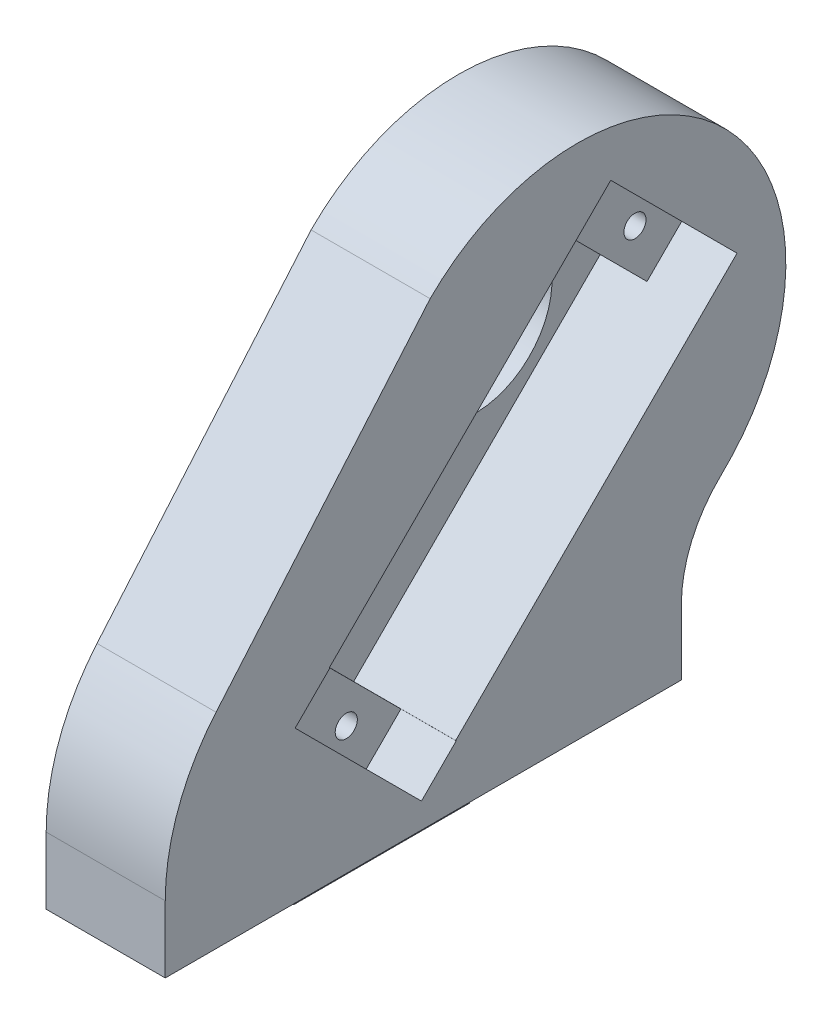
ISO-10303-21;
HEADER;
FILE_DESCRIPTION(('STEP AP214'),'2;1');
FILE_NAME('part.step','',(''),(''),'','','');
FILE_SCHEMA(('AUTOMOTIVE_DESIGN { 1 0 10303 214 1 1 1 1 }'));
ENDSEC;
DATA;
#1=APPLICATION_CONTEXT('core data for automotive mechanical design processes');
#2=APPLICATION_PROTOCOL_DEFINITION('international standard','automotive_design',2000,#1);
#3=PRODUCT_CONTEXT('',#1,'mechanical');
#4=PRODUCT('Part','Part','',(#3));
#5=PRODUCT_RELATED_PRODUCT_CATEGORY('part','',(#4));
#6=PRODUCT_DEFINITION_FORMATION('','',#4);
#7=PRODUCT_DEFINITION_CONTEXT('part definition',#1,'design');
#8=PRODUCT_DEFINITION('design','',#6,#7);
#9=PRODUCT_DEFINITION_SHAPE('','',#8);
#10=(LENGTH_UNIT() NAMED_UNIT(*) SI_UNIT(.MILLI.,.METRE.));
#11=(NAMED_UNIT(*) PLANE_ANGLE_UNIT() SI_UNIT($,.RADIAN.));
#12=(NAMED_UNIT(*) SI_UNIT($,.STERADIAN.) SOLID_ANGLE_UNIT());
#13=UNCERTAINTY_MEASURE_WITH_UNIT(LENGTH_MEASURE(1.E-05),#10,'distance_accuracy_value','');
#14=(GEOMETRIC_REPRESENTATION_CONTEXT(3) GLOBAL_UNCERTAINTY_ASSIGNED_CONTEXT((#13)) GLOBAL_UNIT_ASSIGNED_CONTEXT((#10,
#11,#12)) REPRESENTATION_CONTEXT('',''));
#15=CARTESIAN_POINT('',(0.,0.,0.));
#16=DIRECTION('',(0.,0.,1.));
#17=DIRECTION('',(1.,0.,0.));
#18=AXIS2_PLACEMENT_3D('',#15,#16,#17);
#19=CARTESIAN_POINT('',(-1.99999999999999,54.948945885554,-13.741729606692));
#20=DIRECTION('',(0.,0.707106781186547,-0.707106781186548));
#21=DIRECTION('',(0.,0.707106781186548,0.707106781186547));
#22=AXIS2_PLACEMENT_3D('',#19,#20,#21);
#23=PLANE('',#22);
#24=DIRECTION('',(0.,-0.707106781186548,-0.707106781186547));
#25=VECTOR('',#24,1.);
#26=CARTESIAN_POINT('',(3.5,54.948945885554,-13.741729606692));
#27=LINE('',#26,#25);
#28=CARTESIAN_POINT('',(3.5,54.948945885554,-13.741729606692));
#29=VERTEX_POINT('',#28);
#30=CARTESIAN_POINT('',(3.5,40.0997034806365,-28.5909720116095));
#31=VERTEX_POINT('',#30);
#32=EDGE_CURVE('E833',#29,#31,#27,.T.);
#33=ORIENTED_EDGE('',*,*,#32,.F.);
#34=DIRECTION('',(1.,0.,0.));
#35=VECTOR('',#34,1.);
#36=CARTESIAN_POINT('',(-1.99999999999999,54.948945885554,-13.741729606692));
#37=LINE('',#36,#35);
#38=CARTESIAN_POINT('',(-1.99999999999999,54.948945885554,-13.741729606692));
#39=VERTEX_POINT('',#38);
#40=EDGE_CURVE('E906',#39,#29,#37,.T.);
#41=ORIENTED_EDGE('',*,*,#40,.F.);
#42=DIRECTION('',(0.,-0.707106781186548,-0.707106781186547));
#43=VECTOR('',#42,1.);
#44=CARTESIAN_POINT('',(-1.99999999999999,54.948945885554,-13.741729606692));
#45=LINE('',#44,#43);
#46=CARTESIAN_POINT('',(-1.99999999999999,40.0997034806365,-28.5909720116095));
#47=VERTEX_POINT('',#46);
#48=EDGE_CURVE('E890',#39,#47,#45,.T.);
#49=ORIENTED_EDGE('',*,*,#48,.T.);
#50=DIRECTION('',(1.,0.,0.));
#51=VECTOR('',#50,1.);
#52=CARTESIAN_POINT('',(-1.99999999999999,40.0997034806365,-28.5909720116095));
#53=LINE('',#52,#51);
#54=EDGE_CURVE('E904',#47,#31,#53,.T.);
#55=ORIENTED_EDGE('',*,*,#54,.T.);
#56=EDGE_LOOP('',(#33,#41,#49,#55));
#57=FACE_BOUND('',#56,.T.);
#58=ADVANCED_FACE('F65',(#57),#23,.F.);
#59=CARTESIAN_POINT('',(-7.99999999999999,4.,0.));
#60=DIRECTION('',(0.,1.,0.));
#61=DIRECTION('',(-1.,0.,0.));
#62=AXIS2_PLACEMENT_3D('',#59,#60,#61);
#63=PLANE('',#62);
#64=DIRECTION('',(1.,0.,0.));
#65=VECTOR('',#64,1.);
#66=CARTESIAN_POINT('',(-98.9638448287514,4.,-26.1299478736219));
#67=LINE('',#66,#65);
#68=CARTESIAN_POINT('',(-4.,4.,-26.1299478736219));
#69=VERTEX_POINT('',#68);
#70=CARTESIAN_POINT('',(10.,4.,-26.1299478736219));
#71=VERTEX_POINT('',#70);
#72=EDGE_CURVE('E278',#69,#71,#67,.T.);
#73=ORIENTED_EDGE('',*,*,#72,.T.);
#74=DIRECTION('',(0.,0.,1.));
#75=VECTOR('',#74,1.);
#76=CARTESIAN_POINT('',(10.,4.,-15.1299478736219));
#77=LINE('',#76,#75);
#78=CARTESIAN_POINT('',(10.,4.,34.549646217337));
#79=VERTEX_POINT('',#78);
#80=EDGE_CURVE('E903',#71,#79,#77,.T.);
#81=ORIENTED_EDGE('',*,*,#80,.T.);
#82=DIRECTION('',(-1.,0.,0.));
#83=VECTOR('',#82,1.);
#84=CARTESIAN_POINT('',(10.,4.,34.5496462173369));
#85=LINE('',#84,#83);
#86=CARTESIAN_POINT('',(-4.,4.,34.549646217337));
#87=VERTEX_POINT('',#86);
#88=EDGE_CURVE('E222',#79,#87,#85,.T.);
#89=ORIENTED_EDGE('',*,*,#88,.T.);
#90=DIRECTION('',(0.,0.,-1.));
#91=VECTOR('',#90,1.);
#92=CARTESIAN_POINT('',(-4.,4.,-26.1299478736219));
#93=LINE('',#92,#91);
#94=EDGE_CURVE('E271',#87,#69,#93,.T.);
#95=ORIENTED_EDGE('',*,*,#94,.T.);
#96=EDGE_LOOP('',(#73,#81,#89,#95));
#97=FACE_BOUND('',#96,.T.);
#98=DIRECTION('',(0.,0.,-1.));
#99=VECTOR('',#98,1.);
#100=CARTESIAN_POINT('',(6.0919121161501,4.,15.549646217337));
#101=LINE('',#100,#99);
#102=CARTESIAN_POINT('',(6.0919121161501,4.,15.549646217337));
#103=VERTEX_POINT('',#102);
#104=CARTESIAN_POINT('',(6.0919121161501,4.,-5.15035378266305));
#105=VERTEX_POINT('',#104);
#106=EDGE_CURVE('E841',#103,#105,#101,.T.);
#107=ORIENTED_EDGE('',*,*,#106,.T.);
#108=DIRECTION('',(-1.,0.,0.));
#109=VECTOR('',#108,1.);
#110=CARTESIAN_POINT('',(6.0919121161501,4.,-5.15035378266305));
#111=LINE('',#110,#109);
#112=CARTESIAN_POINT('',(-0.908087883849897,4.,-5.15035378266305));
#113=VERTEX_POINT('',#112);
#114=EDGE_CURVE('E844',#105,#113,#111,.T.);
#115=ORIENTED_EDGE('',*,*,#114,.T.);
#116=DIRECTION('',(0.,0.,1.));
#117=VECTOR('',#116,1.);
#118=CARTESIAN_POINT('',(-0.908087883849897,4.,15.549646217337));
#119=LINE('',#118,#117);
#120=CARTESIAN_POINT('',(-0.908087883849897,4.,15.549646217337));
#121=VERTEX_POINT('',#120);
#122=EDGE_CURVE('E865',#113,#121,#119,.T.);
#123=ORIENTED_EDGE('',*,*,#122,.T.);
#124=DIRECTION('',(1.,0.,0.));
#125=VECTOR('',#124,1.);
#126=CARTESIAN_POINT('',(6.0919121161501,4.,15.549646217337));
#127=LINE('',#126,#125);
#128=EDGE_CURVE('E854',#121,#103,#127,.T.);
#129=ORIENTED_EDGE('',*,*,#128,.T.);
#130=EDGE_LOOP('',(#107,#115,#123,#129));
#131=FACE_BOUND('',#130,.T.);
#132=ADVANCED_FACE('F722',(#97,#131),#63,.F.);
#133=CARTESIAN_POINT('',(-98.9638448287514,0.,-26.1299478736219));
#134=DIRECTION('',(0.,0.,-1.));
#135=DIRECTION('',(1.,0.,0.));
#136=AXIS2_PLACEMENT_3D('',#133,#134,#135);
#137=PLANE('',#136);
#138=DIRECTION('',(0.,1.,0.));
#139=VECTOR('',#138,1.);
#140=CARTESIAN_POINT('',(10.,0.,-26.1299478736219));
#141=LINE('',#140,#139);
#142=CARTESIAN_POINT('',(10.,11.644549615917,-26.1299478736219));
#143=VERTEX_POINT('',#142);
#144=EDGE_CURVE('E918',#71,#143,#141,.T.);
#145=ORIENTED_EDGE('',*,*,#144,.F.);
#146=ORIENTED_EDGE('',*,*,#72,.F.);
#147=DIRECTION('',(0.,1.,0.));
#148=VECTOR('',#147,1.);
#149=CARTESIAN_POINT('',(-4.,19.0366427296958,-26.1299478736219));
#150=LINE('',#149,#148);
#151=CARTESIAN_POINT('',(-4.,11.644549615917,-26.1299478736219));
#152=VERTEX_POINT('',#151);
#153=EDGE_CURVE('E268',#69,#152,#150,.T.);
#154=ORIENTED_EDGE('',*,*,#153,.T.);
#155=DIRECTION('',(-1.,0.,0.));
#156=VECTOR('',#155,1.);
#157=CARTESIAN_POINT('',(-4.,11.644549615917,-26.1299478736219));
#158=LINE('',#157,#156);
#159=EDGE_CURVE('E238',#143,#152,#158,.T.);
#160=ORIENTED_EDGE('',*,*,#159,.F.);
#161=EDGE_LOOP('',(#145,#146,#154,#160));
#162=FACE_BOUND('',#161,.T.);
#163=ADVANCED_FACE('F718',(#162),#137,.T.);
#164=CARTESIAN_POINT('',(-98.9638448287514,40.2764801759331,-13.9185063019886));
#165=DIRECTION('',(1.,0.,0.));
#166=DIRECTION('',(0.,0.,1.));
#167=AXIS2_PLACEMENT_3D('',#164,#165,#166);
#168=CYLINDRICAL_SURFACE('',#167,24.5);
#169=CARTESIAN_POINT('',(10.,40.2764801759331,-13.9185063019886));
#170=DIRECTION('',(-1.,0.,0.));
#171=DIRECTION('',(0.,0.,1.));
#172=AXIS2_PLACEMENT_3D('',#169,#170,#171);
#173=CIRCLE('',#172,24.5);
#174=CARTESIAN_POINT('',(10.,22.5174346387079,-30.796489048951));
#175=VERTEX_POINT('',#174);
#176=CARTESIAN_POINT('',(10.,57.6005963150038,3.40560983708185));
#177=VERTEX_POINT('',#176);
#178=EDGE_CURVE('E261',#175,#177,#173,.F.);
#179=ORIENTED_EDGE('',*,*,#178,.F.);
#180=DIRECTION('',(1.,0.,0.));
#181=VECTOR('',#180,1.);
#182=CARTESIAN_POINT('',(-98.9638448287514,22.5174346387079,-30.796489048951));
#183=LINE('',#182,#181);
#184=CARTESIAN_POINT('',(-4.,22.5174346387078,-30.7964890489511));
#185=VERTEX_POINT('',#184);
#186=EDGE_CURVE('E228',#185,#175,#183,.T.);
#187=ORIENTED_EDGE('',*,*,#186,.F.);
#188=CARTESIAN_POINT('',(-4.,40.2764801759331,-13.9185063019886));
#189=DIRECTION('',(1.,0.,0.));
#190=DIRECTION('',(0.,0.,1.));
#191=AXIS2_PLACEMENT_3D('',#188,#189,#190);
#192=CIRCLE('',#191,24.5000000000001);
#193=CARTESIAN_POINT('',(-4.,57.6005963150038,3.40560983708186));
#194=VERTEX_POINT('',#193);
#195=EDGE_CURVE('E260',#185,#194,#192,.T.);
#196=ORIENTED_EDGE('',*,*,#195,.T.);
#197=DIRECTION('',(1.,0.,0.));
#198=VECTOR('',#197,1.);
#199=CARTESIAN_POINT('',(-98.9638448287514,57.6005963150038,3.40560983708185));
#200=LINE('',#199,#198);
#201=EDGE_CURVE('E240',#194,#177,#200,.T.);
#202=ORIENTED_EDGE('',*,*,#201,.T.);
#203=EDGE_LOOP('',(#179,#187,#196,#202));
#204=FACE_BOUND('',#203,.T.);
#205=ADVANCED_FACE('F258',(#204),#168,.T.);
#206=CARTESIAN_POINT('',(-98.9638448287514,25.9248128608695,30.4097431541046));
#207=DIRECTION('',(0.,-0.648759583452649,-0.760993431560579));
#208=DIRECTION('',(0.,-0.760993431560579,0.648759583452649));
#209=AXIS2_PLACEMENT_3D('',#206,#207,#208);
#210=PLANE('',#209);
#211=DIRECTION('',(1.,0.,0.));
#212=VECTOR('',#211,1.);
#213=CARTESIAN_POINT('',(-98.9638448287514,28.0775697746182,28.5744820063514));
#214=LINE('',#213,#212);
#215=CARTESIAN_POINT('',(10.,28.0775697746182,28.5744820063514));
#216=VERTEX_POINT('',#215);
#217=CARTESIAN_POINT('',(-4.,28.0775697746182,28.5744820063514));
#218=VERTEX_POINT('',#217);
#219=EDGE_CURVE('E74',#216,#218,#214,.F.);
#220=ORIENTED_EDGE('',*,*,#219,.F.);
#221=DIRECTION('',(0.,0.760993431560579,-0.648759583452649));
#222=VECTOR('',#221,1.);
#223=CARTESIAN_POINT('',(10.,25.9248128608695,30.4097431541046));
#224=LINE('',#223,#222);
#225=EDGE_CURVE('E82',#216,#177,#224,.T.);
#226=ORIENTED_EDGE('',*,*,#225,.T.);
#227=ORIENTED_EDGE('',*,*,#201,.F.);
#228=DIRECTION('',(0.,-0.760993431560579,0.648759583452649));
#229=VECTOR('',#228,1.);
#230=CARTESIAN_POINT('',(-4.,21.0687165213735,34.549646217337));
#231=LINE('',#230,#229);
#232=EDGE_CURVE('E266',#194,#218,#231,.T.);
#233=ORIENTED_EDGE('',*,*,#232,.T.);
#234=EDGE_LOOP('',(#220,#226,#227,#233));
#235=FACE_BOUND('',#234,.T.);
#236=ADVANCED_FACE('F726',(#235),#210,.F.);
#237=CARTESIAN_POINT('',(10.,0.,34.5496462173369));
#238=DIRECTION('',(0.,0.,-1.));
#239=DIRECTION('',(1.,0.,0.));
#240=AXIS2_PLACEMENT_3D('',#237,#238,#239);
#241=PLANE('',#240);
#242=ORIENTED_EDGE('',*,*,#88,.F.);
#243=DIRECTION('',(0.,1.,0.));
#244=VECTOR('',#243,1.);
#245=CARTESIAN_POINT('',(10.,0.,34.5496462173369));
#246=LINE('',#245,#244);
#247=CARTESIAN_POINT('',(10.,11.858580188302,34.549646217337));
#248=VERTEX_POINT('',#247);
#249=EDGE_CURVE('E210',#79,#248,#246,.T.);
#250=ORIENTED_EDGE('',*,*,#249,.T.);
#251=DIRECTION('',(1.,0.,0.));
#252=VECTOR('',#251,1.);
#253=CARTESIAN_POINT('',(10.,11.858580188302,34.549646217337));
#254=LINE('',#253,#252);
#255=CARTESIAN_POINT('',(-4.,11.858580188302,34.549646217337));
#256=VERTEX_POINT('',#255);
#257=EDGE_CURVE('E220',#256,#248,#254,.T.);
#258=ORIENTED_EDGE('',*,*,#257,.F.);
#259=DIRECTION('',(0.,-1.,0.));
#260=VECTOR('',#259,1.);
#261=CARTESIAN_POINT('',(-4.,4.,34.549646217337));
#262=LINE('',#261,#260);
#263=EDGE_CURVE('E911',#256,#87,#262,.T.);
#264=ORIENTED_EDGE('',*,*,#263,.T.);
#265=EDGE_LOOP('',(#242,#250,#258,#264));
#266=FACE_BOUND('',#265,.T.);
#267=ADVANCED_FACE('F218',(#266),#241,.F.);
#268=CARTESIAN_POINT('',(-4.,40.2764801759331,-13.9185063019886));
#269=DIRECTION('',(1.,0.,0.));
#270=DIRECTION('',(0.,0.,1.));
#271=AXIS2_PLACEMENT_3D('',#268,#269,#270);
#272=PLANE('',#271);
#273=CARTESIAN_POINT('',(-4.,19.5936068262266,13.8354348595834));
#274=DIRECTION('',(1.,0.,0.));
#275=DIRECTION('',(0.,0.,-1.));
#276=AXIS2_PLACEMENT_3D('',#273,#274,#275);
#277=CIRCLE('',#276,1.29999999999999);
#278=CARTESIAN_POINT('',(-4.,19.5936068262266,12.5354348595834));
#279=VERTEX_POINT('',#278);
#280=EDGE_CURVE('E936',#279,#279,#277,.T.);
#281=ORIENTED_EDGE('',*,*,#280,.T.);
#282=EDGE_LOOP('',(#281));
#283=FACE_BOUND('',#282,.T.);
#284=CARTESIAN_POINT('',(-4.,12.5225390143611,6.76436704771787));
#285=DIRECTION('',(1.,0.,0.));
#286=DIRECTION('',(0.,0.,-1.));
#287=AXIS2_PLACEMENT_3D('',#284,#285,#286);
#288=CIRCLE('',#287,1.29999999999999);
#289=CARTESIAN_POINT('',(-4.,12.5225390143611,5.46436704771788));
#290=VERTEX_POINT('',#289);
#291=EDGE_CURVE('E942',#290,#290,#288,.T.);
#292=ORIENTED_EDGE('',*,*,#291,.T.);
#293=EDGE_LOOP('',(#292));
#294=FACE_BOUND('',#293,.T.);
#295=CARTESIAN_POINT('',(-4.,53.5347323231809,-20.1056906373709));
#296=DIRECTION('',(1.,0.,0.));
#297=DIRECTION('',(0.,0.,-1.));
#298=AXIS2_PLACEMENT_3D('',#295,#296,#297);
#299=CIRCLE('',#298,1.29999999999999);
#300=CARTESIAN_POINT('',(-4.,53.5347323231809,-21.4056906373709));
#301=VERTEX_POINT('',#300);
#302=EDGE_CURVE('E939',#301,#301,#299,.T.);
#303=ORIENTED_EDGE('',*,*,#302,.T.);
#304=EDGE_LOOP('',(#303));
#305=FACE_BOUND('',#304,.T.);
#306=CARTESIAN_POINT('',(-4.,46.4636645113155,-27.1767584492364));
#307=DIRECTION('',(1.,0.,0.));
#308=DIRECTION('',(0.,0.,-1.));
#309=AXIS2_PLACEMENT_3D('',#306,#307,#308);
#310=CIRCLE('',#309,1.29999999999999);
#311=CARTESIAN_POINT('',(-4.,46.4636645113155,-28.4767584492364));
#312=VERTEX_POINT('',#311);
#313=EDGE_CURVE('E933',#312,#312,#310,.T.);
#314=ORIENTED_EDGE('',*,*,#313,.T.);
#315=EDGE_LOOP('',(#314));
#316=FACE_BOUND('',#315,.T.);
#317=CARTESIAN_POINT('',(-4.,40.2764801759331,-13.9185063019886));
#318=DIRECTION('',(-1.,0.,0.));
#319=DIRECTION('',(0.,0.,1.));
#320=AXIS2_PLACEMENT_3D('',#317,#318,#319);
#321=CIRCLE('',#320,8.99999999999999);
#322=CARTESIAN_POINT('',(-4.,40.2764801759331,-4.91850630198863));
#323=VERTEX_POINT('',#322);
#324=EDGE_CURVE('E880',#323,#323,#321,.T.);
#325=ORIENTED_EDGE('',*,*,#324,.F.);
#326=EDGE_LOOP('',(#325));
#327=FACE_BOUND('',#326,.T.);
#328=ORIENTED_EDGE('',*,*,#232,.F.);
#329=ORIENTED_EDGE('',*,*,#195,.F.);
#330=CARTESIAN_POINT('',(-4.,11.644549615917,-41.1299478736219));
#331=DIRECTION('',(-1.,0.,0.));
#332=DIRECTION('',(0.,0.,1.));
#333=AXIS2_PLACEMENT_3D('',#330,#331,#332);
#334=CIRCLE('',#333,15.);
#335=EDGE_CURVE('E225',#152,#185,#334,.T.);
#336=ORIENTED_EDGE('',*,*,#335,.F.);
#337=ORIENTED_EDGE('',*,*,#153,.F.);
#338=ORIENTED_EDGE('',*,*,#94,.F.);
#339=ORIENTED_EDGE('',*,*,#263,.F.);
#340=CARTESIAN_POINT('',(-4.,11.858580188302,9.54964621733696));
#341=DIRECTION('',(-1.,0.,0.));
#342=DIRECTION('',(0.,0.,1.));
#343=AXIS2_PLACEMENT_3D('',#340,#341,#342);
#344=CIRCLE('',#343,25.);
#345=EDGE_CURVE('E13',#218,#256,#344,.F.);
#346=ORIENTED_EDGE('',*,*,#345,.F.);
#347=EDGE_LOOP('',(#328,#329,#336,#337,#338,#339,#346));
#348=FACE_BOUND('',#347,.T.);
#349=ADVANCED_FACE('F263',(#283,#294,#305,#316,#327,#348),#272,.F.);
#350=CARTESIAN_POINT('',(10.,24.7119793601216,22.6009444067097));
#351=DIRECTION('',(1.,0.,0.));
#352=DIRECTION('',(0.,0.,1.));
#353=AXIS2_PLACEMENT_3D('',#350,#351,#352);
#354=PLANE('',#353);
#355=DIRECTION('',(0.,0.707106781186548,-0.707106781186548));
#356=VECTOR('',#355,1.);
#357=CARTESIAN_POINT('',(10.,25.9575678569056,15.2496484219565));
#358=LINE('',#357,#356);
#359=CARTESIAN_POINT('',(10.,25.9575678569056,15.2496484219565));
#360=VERTEX_POINT('',#359);
#361=CARTESIAN_POINT('',(10.,59.0360747026256,-17.8288584237636));
#362=VERTEX_POINT('',#361);
#363=EDGE_CURVE('E897',#360,#362,#358,.T.);
#364=ORIENTED_EDGE('',*,*,#363,.T.);
#365=DIRECTION('',(0.,0.707106781186546,0.707106781186549));
#366=VECTOR('',#365,1.);
#367=CARTESIAN_POINT('',(10.,59.0360747026256,-17.8288584237636));
#368=LINE('',#367,#366);
#369=CARTESIAN_POINT('',(10.,44.1868322977081,-32.6781008286811));
#370=VERTEX_POINT('',#369);
#371=EDGE_CURVE('E948',#370,#362,#368,.T.);
#372=ORIENTED_EDGE('',*,*,#371,.F.);
#373=DIRECTION('',(0.,-0.707106781186547,0.707106781186547));
#374=VECTOR('',#373,1.);
#375=CARTESIAN_POINT('',(10.,40.0997034806365,-28.5909720116095));
#376=LINE('',#375,#374);
#377=CARTESIAN_POINT('',(10.,11.108325451988,0.400406017038955));
#378=VERTEX_POINT('',#377);
#379=EDGE_CURVE('E888',#370,#378,#376,.T.);
#380=ORIENTED_EDGE('',*,*,#379,.T.);
#381=DIRECTION('',(0.,0.707106781186548,0.707106781186547));
#382=VECTOR('',#381,1.);
#383=CARTESIAN_POINT('',(10.,11.108325451988,0.400406017038955));
#384=LINE('',#383,#382);
#385=EDGE_CURVE('E883',#378,#360,#384,.T.);
#386=ORIENTED_EDGE('',*,*,#385,.T.);
#387=EDGE_LOOP('',(#364,#372,#380,#386));
#388=FACE_BOUND('',#387,.T.);
#389=DIRECTION('',(0.,-0.707106781186547,-0.707106781186547));
#390=VECTOR('',#389,1.);
#391=CARTESIAN_POINT('',(10.,21.8025485079064,19.2773186975336));
#392=LINE('',#391,#390);
#393=CARTESIAN_POINT('',(10.,21.8025485079064,19.2773186975336));
#394=VERTEX_POINT('',#393);
#395=CARTESIAN_POINT('',(10.,6.95330610298891,4.42807629261605));
#396=VERTEX_POINT('',#395);
#397=EDGE_CURVE('E90',#394,#396,#392,.T.);
#398=ORIENTED_EDGE('',*,*,#397,.F.);
#399=DIRECTION('',(0.,-0.707106781186547,0.707106781186547));
#400=VECTOR('',#399,1.);
#401=CARTESIAN_POINT('',(10.,21.8025485079064,19.2773186975336));
#402=LINE('',#401,#400);
#403=CARTESIAN_POINT('',(10.,25.889677324978,15.190189880462));
#404=VERTEX_POINT('',#403);
#405=EDGE_CURVE('E972',#404,#394,#402,.T.);
#406=ORIENTED_EDGE('',*,*,#405,.F.);
#407=DIRECTION('',(0.,0.707106781186547,0.707106781186547));
#408=VECTOR('',#407,1.);
#409=CARTESIAN_POINT('',(10.,25.889677324978,15.190189880462));
#410=LINE('',#409,#408);
#411=CARTESIAN_POINT('',(10.,11.0404349200605,0.340947475544445));
#412=VERTEX_POINT('',#411);
#413=EDGE_CURVE('E975',#412,#404,#410,.T.);
#414=ORIENTED_EDGE('',*,*,#413,.F.);
#415=DIRECTION('',(0.,0.707106781186547,-0.707106781186547));
#416=VECTOR('',#415,1.);
#417=CARTESIAN_POINT('',(10.,6.9533061029889,4.42807629261605));
#418=LINE('',#417,#416);
#419=EDGE_CURVE('E979',#396,#412,#418,.T.);
#420=ORIENTED_EDGE('',*,*,#419,.F.);
#421=EDGE_LOOP('',(#398,#406,#414,#420));
#422=FACE_BOUND('',#421,.T.);
#423=ORIENTED_EDGE('',*,*,#249,.F.);
#424=ORIENTED_EDGE('',*,*,#80,.F.);
#425=ORIENTED_EDGE('',*,*,#144,.T.);
#426=CARTESIAN_POINT('',(10.,11.644549615917,-41.1299478736219));
#427=DIRECTION('',(-1.,0.,0.));
#428=DIRECTION('',(0.,0.,1.));
#429=AXIS2_PLACEMENT_3D('',#426,#427,#428);
#430=CIRCLE('',#429,15.);
#431=EDGE_CURVE('E251',#175,#143,#430,.F.);
#432=ORIENTED_EDGE('',*,*,#431,.F.);
#433=ORIENTED_EDGE('',*,*,#178,.T.);
#434=ORIENTED_EDGE('',*,*,#225,.F.);
#435=CARTESIAN_POINT('',(10.,11.858580188302,9.54964621733696));
#436=DIRECTION('',(-1.,0.,0.));
#437=DIRECTION('',(0.,0.,1.));
#438=AXIS2_PLACEMENT_3D('',#435,#436,#437);
#439=CIRCLE('',#438,25.);
#440=EDGE_CURVE('E207',#216,#248,#439,.F.);
#441=ORIENTED_EDGE('',*,*,#440,.T.);
#442=EDGE_LOOP('',(#423,#424,#425,#432,#433,#434,#441));
#443=FACE_BOUND('',#442,.T.);
#444=ADVANCED_FACE('F209',(#388,#422,#443),#354,.T.);
#445=CARTESIAN_POINT('',(-1.99999999999999,11.108325451988,0.400406017038955));
#446=DIRECTION('',(0.,-0.707106781186547,0.707106781186548));
#447=DIRECTION('',(0.,-0.707106781186548,-0.707106781186547));
#448=AXIS2_PLACEMENT_3D('',#445,#446,#447);
#449=PLANE('',#448);
#450=ORIENTED_EDGE('',*,*,#385,.F.);
#451=DIRECTION('',(1.,0.,0.));
#452=VECTOR('',#451,1.);
#453=CARTESIAN_POINT('',(-1.99999999999999,11.108325451988,0.400406017038955));
#454=LINE('',#453,#452);
#455=CARTESIAN_POINT('',(-1.99999999999999,11.108325451988,0.400406017038955));
#456=VERTEX_POINT('',#455);
#457=EDGE_CURVE('E901',#456,#378,#454,.T.);
#458=ORIENTED_EDGE('',*,*,#457,.F.);
#459=DIRECTION('',(0.,0.707106781186548,0.707106781186547));
#460=VECTOR('',#459,1.);
#461=CARTESIAN_POINT('',(-1.99999999999999,11.108325451988,0.400406017038955));
#462=LINE('',#461,#460);
#463=CARTESIAN_POINT('',(-1.99999999999999,25.9575678569056,15.2496484219565));
#464=VERTEX_POINT('',#463);
#465=EDGE_CURVE('E884',#456,#464,#462,.T.);
#466=ORIENTED_EDGE('',*,*,#465,.T.);
#467=DIRECTION('',(1.,0.,0.));
#468=VECTOR('',#467,1.);
#469=CARTESIAN_POINT('',(-1.99999999999999,25.9575678569056,15.2496484219565));
#470=LINE('',#469,#468);
#471=EDGE_CURVE('E894',#464,#360,#470,.T.);
#472=ORIENTED_EDGE('',*,*,#471,.T.);
#473=EDGE_LOOP('',(#450,#458,#466,#472));
#474=FACE_BOUND('',#473,.T.);
#475=ADVANCED_FACE('F741',(#474),#449,.F.);
#476=CARTESIAN_POINT('',(-1.99999999999999,40.0997034806365,-28.5909720116095));
#477=DIRECTION('',(0.,-0.707106781186548,-0.707106781186548));
#478=DIRECTION('',(0.,0.707106781186548,-0.707106781186548));
#479=AXIS2_PLACEMENT_3D('',#476,#477,#478);
#480=PLANE('',#479);
#481=ORIENTED_EDGE('',*,*,#379,.F.);
#482=DIRECTION('',(1.,0.,0.));
#483=VECTOR('',#482,1.);
#484=CARTESIAN_POINT('',(3.5,44.1868322977081,-32.6781008286811));
#485=LINE('',#484,#483);
#486=CARTESIAN_POINT('',(3.5,44.1868322977081,-32.6781008286811));
#487=VERTEX_POINT('',#486);
#488=EDGE_CURVE('E955',#487,#370,#485,.T.);
#489=ORIENTED_EDGE('',*,*,#488,.F.);
#490=DIRECTION('',(0.,0.707106781186549,-0.707106781186546));
#491=VECTOR('',#490,1.);
#492=CARTESIAN_POINT('',(3.5,40.0997034806365,-28.5909720116095));
#493=LINE('',#492,#491);
#494=EDGE_CURVE('E947',#31,#487,#493,.T.);
#495=ORIENTED_EDGE('',*,*,#494,.F.);
#496=ORIENTED_EDGE('',*,*,#54,.F.);
#497=DIRECTION('',(0.,-0.707106781186547,0.707106781186547));
#498=VECTOR('',#497,1.);
#499=CARTESIAN_POINT('',(-1.99999999999999,40.0997034806365,-28.5909720116095));
#500=LINE('',#499,#498);
#501=EDGE_CURVE('E892',#47,#456,#500,.T.);
#502=ORIENTED_EDGE('',*,*,#501,.T.);
#503=ORIENTED_EDGE('',*,*,#457,.T.);
#504=EDGE_LOOP('',(#481,#489,#495,#496,#502,#503));
#505=FACE_BOUND('',#504,.T.);
#506=ADVANCED_FACE('F745',(#505),#480,.F.);
#507=CARTESIAN_POINT('',(-1.99999999999999,25.9575678569056,15.2496484219565));
#508=DIRECTION('',(0.,0.707106781186547,0.707106781186548));
#509=DIRECTION('',(0.,-0.707106781186548,0.707106781186547));
#510=AXIS2_PLACEMENT_3D('',#507,#508,#509);
#511=PLANE('',#510);
#512=ORIENTED_EDGE('',*,*,#363,.F.);
#513=ORIENTED_EDGE('',*,*,#471,.F.);
#514=DIRECTION('',(0.,0.707106781186548,-0.707106781186548));
#515=VECTOR('',#514,1.);
#516=CARTESIAN_POINT('',(-1.99999999999999,25.9575678569056,15.2496484219565));
#517=LINE('',#516,#515);
#518=EDGE_CURVE('E887',#464,#39,#517,.T.);
#519=ORIENTED_EDGE('',*,*,#518,.T.);
#520=ORIENTED_EDGE('',*,*,#40,.T.);
#521=DIRECTION('',(0.,-0.707106781186549,0.707106781186546));
#522=VECTOR('',#521,1.);
#523=CARTESIAN_POINT('',(3.5,54.948945885554,-13.741729606692));
#524=LINE('',#523,#522);
#525=CARTESIAN_POINT('',(3.5,59.0360747026256,-17.8288584237636));
#526=VERTEX_POINT('',#525);
#527=EDGE_CURVE('E953',#526,#29,#524,.T.);
#528=ORIENTED_EDGE('',*,*,#527,.F.);
#529=DIRECTION('',(1.,0.,0.));
#530=VECTOR('',#529,1.);
#531=CARTESIAN_POINT('',(3.5,59.0360747026256,-17.8288584237636));
#532=LINE('',#531,#530);
#533=EDGE_CURVE('E958',#526,#362,#532,.T.);
#534=ORIENTED_EDGE('',*,*,#533,.T.);
#535=EDGE_LOOP('',(#512,#513,#519,#520,#528,#534));
#536=FACE_BOUND('',#535,.T.);
#537=ADVANCED_FACE('F747',(#536),#511,.F.);
#538=CARTESIAN_POINT('',(-1.99999999999999,0.,0.));
#539=DIRECTION('',(1.,0.,0.));
#540=DIRECTION('',(0.,0.,1.));
#541=AXIS2_PLACEMENT_3D('',#538,#539,#540);
#542=PLANE('',#541);
#543=CARTESIAN_POINT('',(-1.99999999999999,40.2764801759331,-13.9185063019886));
#544=DIRECTION('',(-1.,0.,0.));
#545=DIRECTION('',(0.,0.,1.));
#546=AXIS2_PLACEMENT_3D('',#543,#544,#545);
#547=CIRCLE('',#546,8.99999999999999);
#548=CARTESIAN_POINT('',(-1.99999999999999,40.2764801759331,-4.91850630198863));
#549=VERTEX_POINT('',#548);
#550=EDGE_CURVE('E877',#549,#549,#547,.T.);
#551=ORIENTED_EDGE('',*,*,#550,.T.);
#552=EDGE_LOOP('',(#551));
#553=FACE_BOUND('',#552,.T.);
#554=ORIENTED_EDGE('',*,*,#465,.F.);
#555=ORIENTED_EDGE('',*,*,#501,.F.);
#556=ORIENTED_EDGE('',*,*,#48,.F.);
#557=ORIENTED_EDGE('',*,*,#518,.F.);
#558=EDGE_LOOP('',(#554,#555,#556,#557));
#559=FACE_BOUND('',#558,.T.);
#560=ADVANCED_FACE('F750',(#553,#559),#542,.T.);
#561=CARTESIAN_POINT('',(-1.99999999999999,40.2764801759331,-13.9185063019886));
#562=DIRECTION('',(1.,0.,0.));
#563=DIRECTION('',(0.,0.,1.));
#564=AXIS2_PLACEMENT_3D('',#561,#562,#563);
#565=CYLINDRICAL_SURFACE('',#564,8.99999999999999);
#566=ORIENTED_EDGE('',*,*,#550,.F.);
#567=EDGE_LOOP('',(#566));
#568=FACE_BOUND('',#567,.T.);
#569=ORIENTED_EDGE('',*,*,#324,.T.);
#570=EDGE_LOOP('',(#569));
#571=FACE_BOUND('',#570,.T.);
#572=ADVANCED_FACE('F760',(#568,#571),#565,.F.);
#573=CARTESIAN_POINT('',(-98.9638448287514,11.644549615917,-41.1299478736219));
#574=DIRECTION('',(1.,0.,0.));
#575=DIRECTION('',(0.,0.,1.));
#576=AXIS2_PLACEMENT_3D('',#573,#574,#575);
#577=CYLINDRICAL_SURFACE('',#576,15.);
#578=ORIENTED_EDGE('',*,*,#186,.T.);
#579=ORIENTED_EDGE('',*,*,#431,.T.);
#580=ORIENTED_EDGE('',*,*,#159,.T.);
#581=ORIENTED_EDGE('',*,*,#335,.T.);
#582=EDGE_LOOP('',(#578,#579,#580,#581));
#583=FACE_BOUND('',#582,.T.);
#584=ADVANCED_FACE('F250',(#583),#577,.F.);
#585=CARTESIAN_POINT('',(10.,11.858580188302,9.54964621733696));
#586=DIRECTION('',(1.,0.,0.));
#587=DIRECTION('',(0.,0.,1.));
#588=AXIS2_PLACEMENT_3D('',#585,#586,#587);
#589=CYLINDRICAL_SURFACE('',#588,25.);
#590=ORIENTED_EDGE('',*,*,#440,.F.);
#591=ORIENTED_EDGE('',*,*,#219,.T.);
#592=ORIENTED_EDGE('',*,*,#345,.T.);
#593=ORIENTED_EDGE('',*,*,#257,.T.);
#594=EDGE_LOOP('',(#590,#591,#592,#593));
#595=FACE_BOUND('',#594,.T.);
#596=ADVANCED_FACE('F67',(#595),#589,.T.);
#597=CARTESIAN_POINT('',(6.0919121161501,0.,15.549646217337));
#598=DIRECTION('',(-1.,0.,0.));
#599=DIRECTION('',(0.,0.,-1.));
#600=AXIS2_PLACEMENT_3D('',#597,#598,#599);
#601=PLANE('',#600);
#602=ORIENTED_EDGE('',*,*,#106,.F.);
#603=DIRECTION('',(0.,1.,0.));
#604=VECTOR('',#603,1.);
#605=CARTESIAN_POINT('',(6.0919121161501,0.,15.549646217337));
#606=LINE('',#605,#604);
#607=CARTESIAN_POINT('',(6.0919121161501,0.,15.549646217337));
#608=VERTEX_POINT('',#607);
#609=EDGE_CURVE('E861',#608,#103,#606,.T.);
#610=ORIENTED_EDGE('',*,*,#609,.F.);
#611=DIRECTION('',(0.,0.,-1.));
#612=VECTOR('',#611,1.);
#613=CARTESIAN_POINT('',(6.0919121161501,0.,15.549646217337));
#614=LINE('',#613,#612);
#615=CARTESIAN_POINT('',(6.0919121161501,0.,-5.15035378266305));
#616=VERTEX_POINT('',#615);
#617=EDGE_CURVE('E850',#608,#616,#614,.T.);
#618=ORIENTED_EDGE('',*,*,#617,.T.);
#619=DIRECTION('',(0.,1.,0.));
#620=VECTOR('',#619,1.);
#621=CARTESIAN_POINT('',(6.0919121161501,0.,-5.15035378266305));
#622=LINE('',#621,#620);
#623=EDGE_CURVE('E875',#616,#105,#622,.T.);
#624=ORIENTED_EDGE('',*,*,#623,.T.);
#625=EDGE_LOOP('',(#602,#610,#618,#624));
#626=FACE_BOUND('',#625,.T.);
#627=ADVANCED_FACE('F784',(#626),#601,.F.);
#628=CARTESIAN_POINT('',(6.0919121161501,0.,-5.15035378266305));
#629=DIRECTION('',(0.,0.,1.));
#630=DIRECTION('',(-1.,0.,0.));
#631=AXIS2_PLACEMENT_3D('',#628,#629,#630);
#632=PLANE('',#631);
#633=ORIENTED_EDGE('',*,*,#114,.F.);
#634=ORIENTED_EDGE('',*,*,#623,.F.);
#635=DIRECTION('',(-1.,0.,0.));
#636=VECTOR('',#635,1.);
#637=CARTESIAN_POINT('',(6.0919121161501,0.,-5.15035378266305));
#638=LINE('',#637,#636);
#639=CARTESIAN_POINT('',(-0.908087883849897,0.,-5.15035378266305));
#640=VERTEX_POINT('',#639);
#641=EDGE_CURVE('E853',#616,#640,#638,.T.);
#642=ORIENTED_EDGE('',*,*,#641,.T.);
#643=DIRECTION('',(0.,1.,0.));
#644=VECTOR('',#643,1.);
#645=CARTESIAN_POINT('',(-0.908087883849897,0.,-5.15035378266305));
#646=LINE('',#645,#644);
#647=EDGE_CURVE('E873',#640,#113,#646,.T.);
#648=ORIENTED_EDGE('',*,*,#647,.T.);
#649=EDGE_LOOP('',(#633,#634,#642,#648));
#650=FACE_BOUND('',#649,.T.);
#651=ADVANCED_FACE('F787',(#650),#632,.F.);
#652=CARTESIAN_POINT('',(-0.908087883849897,0.,15.549646217337));
#653=DIRECTION('',(1.,0.,0.));
#654=DIRECTION('',(0.,0.,1.));
#655=AXIS2_PLACEMENT_3D('',#652,#653,#654);
#656=PLANE('',#655);
#657=ORIENTED_EDGE('',*,*,#122,.F.);
#658=ORIENTED_EDGE('',*,*,#647,.F.);
#659=DIRECTION('',(0.,0.,1.));
#660=VECTOR('',#659,1.);
#661=CARTESIAN_POINT('',(-0.908087883849897,0.,15.549646217337));
#662=LINE('',#661,#660);
#663=CARTESIAN_POINT('',(-0.908087883849897,0.,15.549646217337));
#664=VERTEX_POINT('',#663);
#665=EDGE_CURVE('E857',#640,#664,#662,.T.);
#666=ORIENTED_EDGE('',*,*,#665,.T.);
#667=DIRECTION('',(0.,1.,0.));
#668=VECTOR('',#667,1.);
#669=CARTESIAN_POINT('',(-0.908087883849897,0.,15.549646217337));
#670=LINE('',#669,#668);
#671=EDGE_CURVE('E871',#664,#121,#670,.T.);
#672=ORIENTED_EDGE('',*,*,#671,.T.);
#673=EDGE_LOOP('',(#657,#658,#666,#672));
#674=FACE_BOUND('',#673,.T.);
#675=ADVANCED_FACE('F791',(#674),#656,.F.);
#676=CARTESIAN_POINT('',(6.0919121161501,0.,15.549646217337));
#677=DIRECTION('',(0.,0.,-1.));
#678=DIRECTION('',(1.,0.,0.));
#679=AXIS2_PLACEMENT_3D('',#676,#677,#678);
#680=PLANE('',#679);
#681=ORIENTED_EDGE('',*,*,#128,.F.);
#682=ORIENTED_EDGE('',*,*,#671,.F.);
#683=DIRECTION('',(1.,0.,0.));
#684=VECTOR('',#683,1.);
#685=CARTESIAN_POINT('',(6.0919121161501,0.,15.549646217337));
#686=LINE('',#685,#684);
#687=EDGE_CURVE('E860',#664,#608,#686,.T.);
#688=ORIENTED_EDGE('',*,*,#687,.T.);
#689=ORIENTED_EDGE('',*,*,#609,.T.);
#690=EDGE_LOOP('',(#681,#682,#688,#689));
#691=FACE_BOUND('',#690,.T.);
#692=ADVANCED_FACE('F795',(#691),#680,.F.);
#693=CARTESIAN_POINT('',(-7.99999999999999,0.,0.));
#694=DIRECTION('',(0.,-1.,0.));
#695=DIRECTION('',(0.,0.,-1.));
#696=AXIS2_PLACEMENT_3D('',#693,#694,#695);
#697=PLANE('',#696);
#698=ORIENTED_EDGE('',*,*,#617,.F.);
#699=ORIENTED_EDGE('',*,*,#687,.F.);
#700=ORIENTED_EDGE('',*,*,#665,.F.);
#701=ORIENTED_EDGE('',*,*,#641,.F.);
#702=EDGE_LOOP('',(#698,#699,#700,#701));
#703=FACE_BOUND('',#702,.T.);
#704=ADVANCED_FACE('F799',(#703),#697,.T.);
#705=CARTESIAN_POINT('',(3.5,0.,0.));
#706=DIRECTION('',(1.,0.,0.));
#707=DIRECTION('',(0.,0.,-1.));
#708=AXIS2_PLACEMENT_3D('',#705,#706,#707);
#709=PLANE('',#708);
#710=DIRECTION('',(0.,-0.707106781186547,-0.707106781186547));
#711=VECTOR('',#710,1.);
#712=CARTESIAN_POINT('',(3.5,21.8025485079064,19.2773186975336));
#713=LINE('',#712,#711);
#714=CARTESIAN_POINT('',(3.5,21.8025485079064,19.2773186975336));
#715=VERTEX_POINT('',#714);
#716=CARTESIAN_POINT('',(3.5,6.9533061029889,4.42807629261605));
#717=VERTEX_POINT('',#716);
#718=EDGE_CURVE('E976',#715,#717,#713,.T.);
#719=ORIENTED_EDGE('',*,*,#718,.T.);
#720=DIRECTION('',(0.,0.707106781186547,-0.707106781186547));
#721=VECTOR('',#720,1.);
#722=CARTESIAN_POINT('',(3.5,6.9533061029889,4.42807629261605));
#723=LINE('',#722,#721);
#724=CARTESIAN_POINT('',(3.5,11.0404349200605,0.340947475544445));
#725=VERTEX_POINT('',#724);
#726=EDGE_CURVE('E988',#717,#725,#723,.T.);
#727=ORIENTED_EDGE('',*,*,#726,.T.);
#728=DIRECTION('',(0.,0.707106781186547,0.707106781186547));
#729=VECTOR('',#728,1.);
#730=CARTESIAN_POINT('',(3.5,25.889677324978,15.190189880462));
#731=LINE('',#730,#729);
#732=CARTESIAN_POINT('',(3.5,25.889677324978,15.190189880462));
#733=VERTEX_POINT('',#732);
#734=EDGE_CURVE('E985',#725,#733,#731,.T.);
#735=ORIENTED_EDGE('',*,*,#734,.T.);
#736=DIRECTION('',(0.,-0.707106781186547,0.707106781186547));
#737=VECTOR('',#736,1.);
#738=CARTESIAN_POINT('',(3.5,21.8025485079064,19.2773186975336));
#739=LINE('',#738,#737);
#740=EDGE_CURVE('E966',#733,#715,#739,.T.);
#741=ORIENTED_EDGE('',*,*,#740,.T.);
#742=EDGE_LOOP('',(#719,#727,#735,#741));
#743=FACE_BOUND('',#742,.T.);
#744=CARTESIAN_POINT('',(3.5,19.5936068262266,13.8354348595834));
#745=DIRECTION('',(1.,0.,0.));
#746=DIRECTION('',(0.,0.,-1.));
#747=AXIS2_PLACEMENT_3D('',#744,#745,#746);
#748=CIRCLE('',#747,1.29999999999999);
#749=CARTESIAN_POINT('',(3.5,19.5936068262266,12.5354348595834));
#750=VERTEX_POINT('',#749);
#751=EDGE_CURVE('E961',#750,#750,#748,.F.);
#752=ORIENTED_EDGE('',*,*,#751,.T.);
#753=EDGE_LOOP('',(#752));
#754=FACE_BOUND('',#753,.T.);
#755=CARTESIAN_POINT('',(3.5,12.5225390143611,6.76436704771787));
#756=DIRECTION('',(1.,0.,0.));
#757=DIRECTION('',(0.,0.,-1.));
#758=AXIS2_PLACEMENT_3D('',#755,#756,#757);
#759=CIRCLE('',#758,1.29999999999999);
#760=CARTESIAN_POINT('',(3.5,12.5225390143611,5.46436704771788));
#761=VERTEX_POINT('',#760);
#762=EDGE_CURVE('E846',#761,#761,#759,.F.);
#763=ORIENTED_EDGE('',*,*,#762,.T.);
#764=EDGE_LOOP('',(#763));
#765=FACE_BOUND('',#764,.T.);
#766=ADVANCED_FACE('F803',(#743,#754,#765),#709,.T.);
#767=CARTESIAN_POINT('',(3.5,21.8025485079064,19.2773186975336));
#768=DIRECTION('',(0.,-0.707106781186548,0.707106781186548));
#769=DIRECTION('',(0.,-0.707106781186548,-0.707106781186548));
#770=AXIS2_PLACEMENT_3D('',#767,#768,#769);
#771=PLANE('',#770);
#772=ORIENTED_EDGE('',*,*,#397,.T.);
#773=DIRECTION('',(1.,0.,0.));
#774=VECTOR('',#773,1.);
#775=CARTESIAN_POINT('',(3.5,6.9533061029889,4.42807629261605));
#776=LINE('',#775,#774);
#777=EDGE_CURVE('E964',#717,#396,#776,.T.);
#778=ORIENTED_EDGE('',*,*,#777,.F.);
#779=ORIENTED_EDGE('',*,*,#718,.F.);
#780=DIRECTION('',(1.,0.,0.));
#781=VECTOR('',#780,1.);
#782=CARTESIAN_POINT('',(3.5,21.8025485079064,19.2773186975336));
#783=LINE('',#782,#781);
#784=EDGE_CURVE('E945',#715,#394,#783,.T.);
#785=ORIENTED_EDGE('',*,*,#784,.T.);
#786=EDGE_LOOP('',(#772,#778,#779,#785));
#787=FACE_BOUND('',#786,.T.);
#788=ADVANCED_FACE('F807',(#787),#771,.F.);
#789=CARTESIAN_POINT('',(3.5,21.8025485079064,19.2773186975336));
#790=DIRECTION('',(0.,0.707106781186548,0.707106781186548));
#791=DIRECTION('',(0.,-0.707106781186548,0.707106781186548));
#792=AXIS2_PLACEMENT_3D('',#789,#790,#791);
#793=PLANE('',#792);
#794=ORIENTED_EDGE('',*,*,#405,.T.);
#795=ORIENTED_EDGE('',*,*,#784,.F.);
#796=ORIENTED_EDGE('',*,*,#740,.F.);
#797=DIRECTION('',(1.,0.,0.));
#798=VECTOR('',#797,1.);
#799=CARTESIAN_POINT('',(3.5,25.889677324978,15.190189880462));
#800=LINE('',#799,#798);
#801=EDGE_CURVE('E969',#733,#404,#800,.T.);
#802=ORIENTED_EDGE('',*,*,#801,.T.);
#803=EDGE_LOOP('',(#794,#795,#796,#802));
#804=FACE_BOUND('',#803,.T.);
#805=ADVANCED_FACE('F809',(#804),#793,.F.);
#806=CARTESIAN_POINT('',(3.5,25.889677324978,15.190189880462));
#807=DIRECTION('',(0.,0.707106781186548,-0.707106781186548));
#808=DIRECTION('',(0.,0.707106781186548,0.707106781186548));
#809=AXIS2_PLACEMENT_3D('',#806,#807,#808);
#810=PLANE('',#809);
#811=ORIENTED_EDGE('',*,*,#413,.T.);
#812=ORIENTED_EDGE('',*,*,#801,.F.);
#813=ORIENTED_EDGE('',*,*,#734,.F.);
#814=DIRECTION('',(1.,0.,0.));
#815=VECTOR('',#814,1.);
#816=CARTESIAN_POINT('',(3.5,11.0404349200605,0.340947475544445));
#817=LINE('',#816,#815);
#818=EDGE_CURVE('E967',#725,#412,#817,.T.);
#819=ORIENTED_EDGE('',*,*,#818,.T.);
#820=EDGE_LOOP('',(#811,#812,#813,#819));
#821=FACE_BOUND('',#820,.T.);
#822=ADVANCED_FACE('F812',(#821),#810,.F.);
#823=CARTESIAN_POINT('',(3.5,6.9533061029889,4.42807629261605));
#824=DIRECTION('',(0.,-0.707106781186548,-0.707106781186548));
#825=DIRECTION('',(0.,0.707106781186548,-0.707106781186548));
#826=AXIS2_PLACEMENT_3D('',#823,#824,#825);
#827=PLANE('',#826);
#828=ORIENTED_EDGE('',*,*,#419,.T.);
#829=ORIENTED_EDGE('',*,*,#818,.F.);
#830=ORIENTED_EDGE('',*,*,#726,.F.);
#831=ORIENTED_EDGE('',*,*,#777,.T.);
#832=EDGE_LOOP('',(#828,#829,#830,#831));
#833=FACE_BOUND('',#832,.T.);
#834=ADVANCED_FACE('F779',(#833),#827,.F.);
#835=CARTESIAN_POINT('',(10.,12.5225390143611,6.76436704771787));
#836=DIRECTION('',(1.,0.,0.));
#837=DIRECTION('',(0.,0.,1.));
#838=AXIS2_PLACEMENT_3D('',#835,#836,#837);
#839=CYLINDRICAL_SURFACE('',#838,1.29999999999999);
#840=ORIENTED_EDGE('',*,*,#762,.F.);
#841=EDGE_LOOP('',(#840));
#842=FACE_BOUND('',#841,.T.);
#843=ORIENTED_EDGE('',*,*,#291,.F.);
#844=EDGE_LOOP('',(#843));
#845=FACE_BOUND('',#844,.T.);
#846=ADVANCED_FACE('F775',(#842,#845),#839,.F.);
#847=CARTESIAN_POINT('',(3.5,0.,0.));
#848=DIRECTION('',(1.,0.,0.));
#849=DIRECTION('',(0.,0.,-1.));
#850=AXIS2_PLACEMENT_3D('',#847,#848,#849);
#851=PLANE('',#850);
#852=ORIENTED_EDGE('',*,*,#32,.T.);
#853=ORIENTED_EDGE('',*,*,#494,.T.);
#854=DIRECTION('',(0.,0.707106781186546,0.707106781186549));
#855=VECTOR('',#854,1.);
#856=CARTESIAN_POINT('',(3.5,59.0360747026256,-17.8288584237636));
#857=LINE('',#856,#855);
#858=EDGE_CURVE('E950',#487,#526,#857,.T.);
#859=ORIENTED_EDGE('',*,*,#858,.T.);
#860=ORIENTED_EDGE('',*,*,#527,.T.);
#861=EDGE_LOOP('',(#852,#853,#859,#860));
#862=FACE_BOUND('',#861,.T.);
#863=CARTESIAN_POINT('',(3.5,46.4636645113155,-27.1767584492364));
#864=DIRECTION('',(1.,0.,0.));
#865=DIRECTION('',(0.,0.,-1.));
#866=AXIS2_PLACEMENT_3D('',#863,#864,#865);
#867=CIRCLE('',#866,1.29999999999999);
#868=CARTESIAN_POINT('',(3.5,46.4636645113155,-28.4767584492364));
#869=VERTEX_POINT('',#868);
#870=EDGE_CURVE('E237',#869,#869,#867,.F.);
#871=ORIENTED_EDGE('',*,*,#870,.T.);
#872=EDGE_LOOP('',(#871));
#873=FACE_BOUND('',#872,.T.);
#874=CARTESIAN_POINT('',(3.5,53.5347323231809,-20.1056906373709));
#875=DIRECTION('',(1.,0.,0.));
#876=DIRECTION('',(0.,0.,-1.));
#877=AXIS2_PLACEMENT_3D('',#874,#875,#876);
#878=CIRCLE('',#877,1.29999999999999);
#879=CARTESIAN_POINT('',(3.5,53.5347323231809,-21.4056906373709));
#880=VERTEX_POINT('',#879);
#881=EDGE_CURVE('E840',#880,#880,#878,.F.);
#882=ORIENTED_EDGE('',*,*,#881,.T.);
#883=EDGE_LOOP('',(#882));
#884=FACE_BOUND('',#883,.T.);
#885=ADVANCED_FACE('F778',(#862,#873,#884),#851,.T.);
#886=CARTESIAN_POINT('',(3.5,59.0360747026256,-17.8288584237636));
#887=DIRECTION('',(0.,0.707106781186549,-0.707106781186546));
#888=DIRECTION('',(0.,0.707106781186546,0.707106781186549));
#889=AXIS2_PLACEMENT_3D('',#886,#887,#888);
#890=PLANE('',#889);
#891=ORIENTED_EDGE('',*,*,#371,.T.);
#892=ORIENTED_EDGE('',*,*,#533,.F.);
#893=ORIENTED_EDGE('',*,*,#858,.F.);
#894=ORIENTED_EDGE('',*,*,#488,.T.);
#895=EDGE_LOOP('',(#891,#892,#893,#894));
#896=FACE_BOUND('',#895,.T.);
#897=ADVANCED_FACE('F769',(#896),#890,.F.);
#898=CARTESIAN_POINT('',(10.,53.5347323231809,-20.1056906373709));
#899=DIRECTION('',(1.,0.,0.));
#900=DIRECTION('',(0.,0.,1.));
#901=AXIS2_PLACEMENT_3D('',#898,#899,#900);
#902=CYLINDRICAL_SURFACE('',#901,1.29999999999999);
#903=ORIENTED_EDGE('',*,*,#881,.F.);
#904=EDGE_LOOP('',(#903));
#905=FACE_BOUND('',#904,.T.);
#906=ORIENTED_EDGE('',*,*,#302,.F.);
#907=EDGE_LOOP('',(#906));
#908=FACE_BOUND('',#907,.T.);
#909=ADVANCED_FACE('F765',(#905,#908),#902,.F.);
#910=CARTESIAN_POINT('',(10.,19.5936068262266,13.8354348595834));
#911=DIRECTION('',(1.,0.,0.));
#912=DIRECTION('',(0.,0.,1.));
#913=AXIS2_PLACEMENT_3D('',#910,#911,#912);
#914=CYLINDRICAL_SURFACE('',#913,1.29999999999999);
#915=ORIENTED_EDGE('',*,*,#751,.F.);
#916=EDGE_LOOP('',(#915));
#917=FACE_BOUND('',#916,.T.);
#918=ORIENTED_EDGE('',*,*,#280,.F.);
#919=EDGE_LOOP('',(#918));
#920=FACE_BOUND('',#919,.T.);
#921=ADVANCED_FACE('F768',(#917,#920),#914,.F.);
#922=CARTESIAN_POINT('',(10.,46.4636645113155,-27.1767584492364));
#923=DIRECTION('',(1.,0.,0.));
#924=DIRECTION('',(0.,0.,1.));
#925=AXIS2_PLACEMENT_3D('',#922,#923,#924);
#926=CYLINDRICAL_SURFACE('',#925,1.29999999999999);
#927=ORIENTED_EDGE('',*,*,#870,.F.);
#928=EDGE_LOOP('',(#927));
#929=FACE_BOUND('',#928,.T.);
#930=ORIENTED_EDGE('',*,*,#313,.F.);
#931=EDGE_LOOP('',(#930));
#932=FACE_BOUND('',#931,.T.);
#933=ADVANCED_FACE('F771',(#929,#932),#926,.F.);
#934=CLOSED_SHELL('',(#58,#132,#163,#205,#236,#267,#349,#444,#475,#506,#537,#560,#572,#584,#596,
#627,#651,#675,#692,#704,#766,#788,#805,#822,#834,#846,#885,#897,#909,#921,#933));
#935=MANIFOLD_SOLID_BREP('B2',#934);
#936=ADVANCED_BREP_SHAPE_REPRESENTATION('',(#18,#935),#14);
#937=SHAPE_DEFINITION_REPRESENTATION(#9,#936);
ENDSEC;
END-ISO-10303-21;
